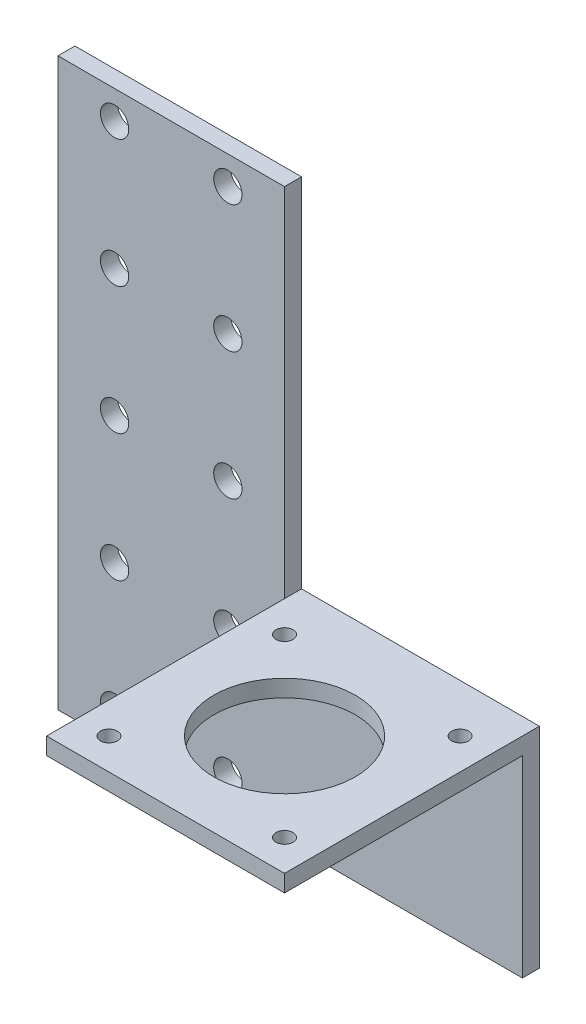
ISO-10303-21;
HEADER;
FILE_DESCRIPTION(('STEP AP214'),'2;1');
FILE_NAME('part.step','',(''),(''),'','','');
FILE_SCHEMA(('AUTOMOTIVE_DESIGN { 1 0 10303 214 1 1 1 1 }'));
ENDSEC;
DATA;
#1=APPLICATION_CONTEXT('core data for automotive mechanical design processes');
#2=APPLICATION_PROTOCOL_DEFINITION('international standard','automotive_design',2000,#1);
#3=PRODUCT_CONTEXT('',#1,'mechanical');
#4=PRODUCT('Part','Part','',(#3));
#5=PRODUCT_RELATED_PRODUCT_CATEGORY('part','',(#4));
#6=PRODUCT_DEFINITION_FORMATION('','',#4);
#7=PRODUCT_DEFINITION_CONTEXT('part definition',#1,'design');
#8=PRODUCT_DEFINITION('design','',#6,#7);
#9=PRODUCT_DEFINITION_SHAPE('','',#8);
#10=(LENGTH_UNIT() NAMED_UNIT(*) SI_UNIT(.MILLI.,.METRE.));
#11=(NAMED_UNIT(*) PLANE_ANGLE_UNIT() SI_UNIT($,.RADIAN.));
#12=(NAMED_UNIT(*) SI_UNIT($,.STERADIAN.) SOLID_ANGLE_UNIT());
#13=UNCERTAINTY_MEASURE_WITH_UNIT(LENGTH_MEASURE(1.E-05),#10,'distance_accuracy_value','');
#14=(GEOMETRIC_REPRESENTATION_CONTEXT(3) GLOBAL_UNCERTAINTY_ASSIGNED_CONTEXT((#13)) GLOBAL_UNIT_ASSIGNED_CONTEXT((#10,
#11,#12)) REPRESENTATION_CONTEXT('',''));
#15=CARTESIAN_POINT('',(0.,0.,0.));
#16=DIRECTION('',(0.,0.,1.));
#17=DIRECTION('',(1.,0.,0.));
#18=AXIS2_PLACEMENT_3D('',#15,#16,#17);
#19=CARTESIAN_POINT('',(40.,0.,3.));
#20=DIRECTION('',(-1.,0.,0.));
#21=DIRECTION('',(0.,-1.,0.));
#22=AXIS2_PLACEMENT_3D('',#19,#20,#21);
#23=PLANE('',#22);
#24=DIRECTION('',(0.,0.,1.));
#25=VECTOR('',#24,1.);
#26=CARTESIAN_POINT('',(40.,-63.,0.));
#27=LINE('',#26,#25);
#28=CARTESIAN_POINT('',(40.,-63.,0.));
#29=VERTEX_POINT('',#28);
#30=CARTESIAN_POINT('',(40.,-63.,3.));
#31=VERTEX_POINT('',#30);
#32=EDGE_CURVE('E55',#29,#31,#27,.T.);
#33=ORIENTED_EDGE('',*,*,#32,.F.);
#34=DIRECTION('',(0.,1.,0.));
#35=VECTOR('',#34,1.);
#36=CARTESIAN_POINT('',(40.,0.,0.));
#37=LINE('',#36,#35);
#38=CARTESIAN_POINT('',(40.,0.,0.));
#39=VERTEX_POINT('',#38);
#40=EDGE_CURVE('E121',#29,#39,#37,.T.);
#41=ORIENTED_EDGE('',*,*,#40,.T.);
#42=DIRECTION('',(0.,0.,-1.));
#43=VECTOR('',#42,1.);
#44=CARTESIAN_POINT('',(40.,0.,3.));
#45=LINE('',#44,#43);
#46=CARTESIAN_POINT('',(40.,0.,3.));
#47=VERTEX_POINT('',#46);
#48=EDGE_CURVE('E11',#47,#39,#45,.T.);
#49=ORIENTED_EDGE('',*,*,#48,.F.);
#50=DIRECTION('',(0.,1.,0.));
#51=VECTOR('',#50,1.);
#52=CARTESIAN_POINT('',(40.,0.,3.));
#53=LINE('',#52,#51);
#54=EDGE_CURVE('E50',#31,#47,#53,.T.);
#55=ORIENTED_EDGE('',*,*,#54,.F.);
#56=EDGE_LOOP('',(#33,#41,#49,#55));
#57=FACE_BOUND('',#56,.T.);
#58=ADVANCED_FACE('F36',(#57),#23,.F.);
#59=CARTESIAN_POINT('',(0.,0.,3.));
#60=DIRECTION('',(0.,0.,1.));
#61=DIRECTION('',(1.,0.,0.));
#62=AXIS2_PLACEMENT_3D('',#59,#60,#61);
#63=PLANE('',#62);
#64=CARTESIAN_POINT('',(30.,-72.5,3.));
#65=DIRECTION('',(0.,0.,1.));
#66=DIRECTION('',(1.,0.,0.));
#67=AXIS2_PLACEMENT_3D('',#64,#65,#66);
#68=CIRCLE('',#67,2.5);
#69=CARTESIAN_POINT('',(32.5,-72.5,3.));
#70=VERTEX_POINT('',#69);
#71=EDGE_CURVE('E155',#70,#70,#68,.T.);
#72=ORIENTED_EDGE('',*,*,#71,.F.);
#73=EDGE_LOOP('',(#72));
#74=FACE_BOUND('',#73,.T.);
#75=CARTESIAN_POINT('',(30.,-27.5,3.));
#76=DIRECTION('',(0.,0.,1.));
#77=DIRECTION('',(1.,0.,0.));
#78=AXIS2_PLACEMENT_3D('',#75,#76,#77);
#79=CIRCLE('',#78,2.5);
#80=CARTESIAN_POINT('',(32.5,-27.5,3.));
#81=VERTEX_POINT('',#80);
#82=EDGE_CURVE('E167',#81,#81,#79,.T.);
#83=ORIENTED_EDGE('',*,*,#82,.F.);
#84=EDGE_LOOP('',(#83));
#85=FACE_BOUND('',#84,.T.);
#86=CARTESIAN_POINT('',(10.,-72.5000000000004,3.));
#87=DIRECTION('',(0.,0.,1.));
#88=DIRECTION('',(1.,0.,0.));
#89=AXIS2_PLACEMENT_3D('',#86,#87,#88);
#90=CIRCLE('',#89,2.5);
#91=CARTESIAN_POINT('',(12.5,-72.5000000000004,3.));
#92=VERTEX_POINT('',#91);
#93=EDGE_CURVE('E179',#92,#92,#90,.T.);
#94=ORIENTED_EDGE('',*,*,#93,.F.);
#95=EDGE_LOOP('',(#94));
#96=FACE_BOUND('',#95,.T.);
#97=CARTESIAN_POINT('',(10.,-27.5000000000004,3.));
#98=DIRECTION('',(0.,0.,1.));
#99=DIRECTION('',(1.,0.,0.));
#100=AXIS2_PLACEMENT_3D('',#97,#98,#99);
#101=CIRCLE('',#100,2.5);
#102=CARTESIAN_POINT('',(12.5,-27.5000000000004,3.));
#103=VERTEX_POINT('',#102);
#104=EDGE_CURVE('E191',#103,#103,#101,.T.);
#105=ORIENTED_EDGE('',*,*,#104,.F.);
#106=EDGE_LOOP('',(#105));
#107=FACE_BOUND('',#106,.T.);
#108=CARTESIAN_POINT('',(10.,-5.00000000000041,3.));
#109=DIRECTION('',(0.,0.,1.));
#110=DIRECTION('',(1.,0.,0.));
#111=AXIS2_PLACEMENT_3D('',#108,#109,#110);
#112=CIRCLE('',#111,2.5);
#113=CARTESIAN_POINT('',(12.5,-5.00000000000041,3.));
#114=VERTEX_POINT('',#113);
#115=EDGE_CURVE('E203',#114,#114,#112,.T.);
#116=ORIENTED_EDGE('',*,*,#115,.F.);
#117=EDGE_LOOP('',(#116));
#118=FACE_BOUND('',#117,.T.);
#119=CARTESIAN_POINT('',(40.,-66.,3.));
#120=VERTEX_POINT('',#119);
#121=EDGE_CURVE('E208',#120,#31,#53,.T.);
#122=ORIENTED_EDGE('',*,*,#121,.T.);
#123=ORIENTED_EDGE('',*,*,#54,.T.);
#124=DIRECTION('',(-1.,0.,0.));
#125=VECTOR('',#124,1.);
#126=CARTESIAN_POINT('',(40.,0.,3.));
#127=LINE('',#126,#125);
#128=CARTESIAN_POINT('',(0.,0.,3.));
#129=VERTEX_POINT('',#128);
#130=EDGE_CURVE('E210',#47,#129,#127,.T.);
#131=ORIENTED_EDGE('',*,*,#130,.T.);
#132=DIRECTION('',(0.,-1.,0.));
#133=VECTOR('',#132,1.);
#134=CARTESIAN_POINT('',(0.,0.,3.));
#135=LINE('',#134,#133);
#136=CARTESIAN_POINT('',(0.,-100.,3.));
#137=VERTEX_POINT('',#136);
#138=EDGE_CURVE('E212',#129,#137,#135,.T.);
#139=ORIENTED_EDGE('',*,*,#138,.T.);
#140=DIRECTION('',(1.,0.,0.));
#141=VECTOR('',#140,1.);
#142=CARTESIAN_POINT('',(82.,-100.,3.));
#143=LINE('',#142,#141);
#144=CARTESIAN_POINT('',(82.,-100.,3.));
#145=VERTEX_POINT('',#144);
#146=EDGE_CURVE('E214',#137,#145,#143,.T.);
#147=ORIENTED_EDGE('',*,*,#146,.T.);
#148=DIRECTION('',(0.,1.,0.));
#149=VECTOR('',#148,1.);
#150=CARTESIAN_POINT('',(82.,-100.,3.));
#151=LINE('',#150,#149);
#152=CARTESIAN_POINT('',(82.,-66.,3.));
#153=VERTEX_POINT('',#152);
#154=EDGE_CURVE('E216',#145,#153,#151,.T.);
#155=ORIENTED_EDGE('',*,*,#154,.T.);
#156=DIRECTION('',(-1.,0.,0.));
#157=VECTOR('',#156,1.);
#158=CARTESIAN_POINT('',(40.,-66.,3.));
#159=LINE('',#158,#157);
#160=EDGE_CURVE('E218',#153,#120,#159,.T.);
#161=ORIENTED_EDGE('',*,*,#160,.T.);
#162=EDGE_LOOP('',(#122,#123,#131,#139,#147,#155,#161));
#163=FACE_BOUND('',#162,.T.);
#164=CARTESIAN_POINT('',(30.,-5.,3.));
#165=DIRECTION('',(0.,0.,1.));
#166=DIRECTION('',(1.,0.,0.));
#167=AXIS2_PLACEMENT_3D('',#164,#165,#166);
#168=CIRCLE('',#167,2.50000000000001);
#169=CARTESIAN_POINT('',(32.5,-5.,3.));
#170=VERTEX_POINT('',#169);
#171=EDGE_CURVE('E197',#170,#170,#168,.T.);
#172=ORIENTED_EDGE('',*,*,#171,.F.);
#173=EDGE_LOOP('',(#172));
#174=FACE_BOUND('',#173,.T.);
#175=CARTESIAN_POINT('',(10.,-50.0000000000004,3.));
#176=DIRECTION('',(0.,0.,1.));
#177=DIRECTION('',(1.,0.,0.));
#178=AXIS2_PLACEMENT_3D('',#175,#176,#177);
#179=CIRCLE('',#178,2.5);
#180=CARTESIAN_POINT('',(12.5,-50.0000000000004,3.));
#181=VERTEX_POINT('',#180);
#182=EDGE_CURVE('E185',#181,#181,#179,.T.);
#183=ORIENTED_EDGE('',*,*,#182,.F.);
#184=EDGE_LOOP('',(#183));
#185=FACE_BOUND('',#184,.T.);
#186=CARTESIAN_POINT('',(10.,-95.0000000000004,3.));
#187=DIRECTION('',(0.,0.,1.));
#188=DIRECTION('',(1.,0.,0.));
#189=AXIS2_PLACEMENT_3D('',#186,#187,#188);
#190=CIRCLE('',#189,2.5);
#191=CARTESIAN_POINT('',(12.5,-95.0000000000004,3.));
#192=VERTEX_POINT('',#191);
#193=EDGE_CURVE('E173',#192,#192,#190,.T.);
#194=ORIENTED_EDGE('',*,*,#193,.F.);
#195=EDGE_LOOP('',(#194));
#196=FACE_BOUND('',#195,.T.);
#197=CARTESIAN_POINT('',(30.,-50.,3.));
#198=DIRECTION('',(0.,0.,1.));
#199=DIRECTION('',(1.,0.,0.));
#200=AXIS2_PLACEMENT_3D('',#197,#198,#199);
#201=CIRCLE('',#200,2.5);
#202=CARTESIAN_POINT('',(32.5,-50.,3.));
#203=VERTEX_POINT('',#202);
#204=EDGE_CURVE('E161',#203,#203,#201,.T.);
#205=ORIENTED_EDGE('',*,*,#204,.F.);
#206=EDGE_LOOP('',(#205));
#207=FACE_BOUND('',#206,.T.);
#208=CARTESIAN_POINT('',(30.,-95.,3.));
#209=DIRECTION('',(0.,0.,1.));
#210=DIRECTION('',(1.,0.,0.));
#211=AXIS2_PLACEMENT_3D('',#208,#209,#210);
#212=CIRCLE('',#211,2.50000000000001);
#213=CARTESIAN_POINT('',(32.5,-95.,3.));
#214=VERTEX_POINT('',#213);
#215=EDGE_CURVE('E149',#214,#214,#212,.T.);
#216=ORIENTED_EDGE('',*,*,#215,.F.);
#217=EDGE_LOOP('',(#216));
#218=FACE_BOUND('',#217,.T.);
#219=ADVANCED_FACE('F242',(#74,#85,#96,#107,#118,#163,#174,#185,#196,#207,#218),#63,.T.);
#220=CARTESIAN_POINT('',(0.,0.,0.));
#221=DIRECTION('',(0.,0.,1.));
#222=DIRECTION('',(1.,0.,0.));
#223=AXIS2_PLACEMENT_3D('',#220,#221,#222);
#224=PLANE('',#223);
#225=ORIENTED_EDGE('',*,*,#40,.F.);
#226=DIRECTION('',(-1.,0.,0.));
#227=VECTOR('',#226,1.);
#228=CARTESIAN_POINT('',(82.,-63.,0.));
#229=LINE('',#228,#227);
#230=CARTESIAN_POINT('',(82.,-63.,0.));
#231=VERTEX_POINT('',#230);
#232=EDGE_CURVE('E117',#231,#29,#229,.T.);
#233=ORIENTED_EDGE('',*,*,#232,.F.);
#234=DIRECTION('',(0.,1.,0.));
#235=VECTOR('',#234,1.);
#236=CARTESIAN_POINT('',(82.,-100.,0.));
#237=LINE('',#236,#235);
#238=CARTESIAN_POINT('',(82.,-100.,0.));
#239=VERTEX_POINT('',#238);
#240=EDGE_CURVE('E103',#239,#231,#237,.T.);
#241=ORIENTED_EDGE('',*,*,#240,.F.);
#242=DIRECTION('',(1.,0.,0.));
#243=VECTOR('',#242,1.);
#244=CARTESIAN_POINT('',(82.,-100.,0.));
#245=LINE('',#244,#243);
#246=CARTESIAN_POINT('',(0.,-100.,0.));
#247=VERTEX_POINT('',#246);
#248=EDGE_CURVE('E114',#247,#239,#245,.T.);
#249=ORIENTED_EDGE('',*,*,#248,.F.);
#250=DIRECTION('',(0.,-1.,0.));
#251=VECTOR('',#250,1.);
#252=CARTESIAN_POINT('',(0.,0.,0.));
#253=LINE('',#252,#251);
#254=CARTESIAN_POINT('',(0.,0.,0.));
#255=VERTEX_POINT('',#254);
#256=EDGE_CURVE('E223',#255,#247,#253,.T.);
#257=ORIENTED_EDGE('',*,*,#256,.F.);
#258=DIRECTION('',(-1.,0.,0.));
#259=VECTOR('',#258,1.);
#260=CARTESIAN_POINT('',(40.,0.,0.));
#261=LINE('',#260,#259);
#262=EDGE_CURVE('E221',#39,#255,#261,.T.);
#263=ORIENTED_EDGE('',*,*,#262,.F.);
#264=EDGE_LOOP('',(#225,#233,#241,#249,#257,#263));
#265=FACE_BOUND('',#264,.T.);
#266=CARTESIAN_POINT('',(10.,-5.00000000000041,0.));
#267=DIRECTION('',(0.,0.,1.));
#268=DIRECTION('',(1.,0.,0.));
#269=AXIS2_PLACEMENT_3D('',#266,#267,#268);
#270=CIRCLE('',#269,2.5);
#271=CARTESIAN_POINT('',(12.5,-5.00000000000041,0.));
#272=VERTEX_POINT('',#271);
#273=EDGE_CURVE('E200',#272,#272,#270,.T.);
#274=ORIENTED_EDGE('',*,*,#273,.T.);
#275=EDGE_LOOP('',(#274));
#276=FACE_BOUND('',#275,.T.);
#277=CARTESIAN_POINT('',(30.,-5.,0.));
#278=DIRECTION('',(0.,0.,1.));
#279=DIRECTION('',(1.,0.,0.));
#280=AXIS2_PLACEMENT_3D('',#277,#278,#279);
#281=CIRCLE('',#280,2.50000000000001);
#282=CARTESIAN_POINT('',(32.5,-5.,0.));
#283=VERTEX_POINT('',#282);
#284=EDGE_CURVE('E194',#283,#283,#281,.T.);
#285=ORIENTED_EDGE('',*,*,#284,.T.);
#286=EDGE_LOOP('',(#285));
#287=FACE_BOUND('',#286,.T.);
#288=CARTESIAN_POINT('',(10.,-27.5000000000004,0.));
#289=DIRECTION('',(0.,0.,1.));
#290=DIRECTION('',(1.,0.,0.));
#291=AXIS2_PLACEMENT_3D('',#288,#289,#290);
#292=CIRCLE('',#291,2.5);
#293=CARTESIAN_POINT('',(12.5,-27.5000000000004,0.));
#294=VERTEX_POINT('',#293);
#295=EDGE_CURVE('E188',#294,#294,#292,.T.);
#296=ORIENTED_EDGE('',*,*,#295,.T.);
#297=EDGE_LOOP('',(#296));
#298=FACE_BOUND('',#297,.T.);
#299=CARTESIAN_POINT('',(10.,-50.0000000000004,0.));
#300=DIRECTION('',(0.,0.,1.));
#301=DIRECTION('',(1.,0.,0.));
#302=AXIS2_PLACEMENT_3D('',#299,#300,#301);
#303=CIRCLE('',#302,2.5);
#304=CARTESIAN_POINT('',(12.5,-50.0000000000004,0.));
#305=VERTEX_POINT('',#304);
#306=EDGE_CURVE('E182',#305,#305,#303,.T.);
#307=ORIENTED_EDGE('',*,*,#306,.T.);
#308=EDGE_LOOP('',(#307));
#309=FACE_BOUND('',#308,.T.);
#310=CARTESIAN_POINT('',(10.,-72.5000000000004,0.));
#311=DIRECTION('',(0.,0.,1.));
#312=DIRECTION('',(1.,0.,0.));
#313=AXIS2_PLACEMENT_3D('',#310,#311,#312);
#314=CIRCLE('',#313,2.5);
#315=CARTESIAN_POINT('',(12.5,-72.5000000000004,0.));
#316=VERTEX_POINT('',#315);
#317=EDGE_CURVE('E176',#316,#316,#314,.T.);
#318=ORIENTED_EDGE('',*,*,#317,.T.);
#319=EDGE_LOOP('',(#318));
#320=FACE_BOUND('',#319,.T.);
#321=CARTESIAN_POINT('',(10.,-95.0000000000004,0.));
#322=DIRECTION('',(0.,0.,1.));
#323=DIRECTION('',(1.,0.,0.));
#324=AXIS2_PLACEMENT_3D('',#321,#322,#323);
#325=CIRCLE('',#324,2.5);
#326=CARTESIAN_POINT('',(12.5,-95.0000000000004,0.));
#327=VERTEX_POINT('',#326);
#328=EDGE_CURVE('E170',#327,#327,#325,.T.);
#329=ORIENTED_EDGE('',*,*,#328,.T.);
#330=EDGE_LOOP('',(#329));
#331=FACE_BOUND('',#330,.T.);
#332=CARTESIAN_POINT('',(30.,-27.5,0.));
#333=DIRECTION('',(0.,0.,1.));
#334=DIRECTION('',(1.,0.,0.));
#335=AXIS2_PLACEMENT_3D('',#332,#333,#334);
#336=CIRCLE('',#335,2.5);
#337=CARTESIAN_POINT('',(32.5,-27.5,0.));
#338=VERTEX_POINT('',#337);
#339=EDGE_CURVE('E164',#338,#338,#336,.T.);
#340=ORIENTED_EDGE('',*,*,#339,.T.);
#341=EDGE_LOOP('',(#340));
#342=FACE_BOUND('',#341,.T.);
#343=CARTESIAN_POINT('',(30.,-50.,0.));
#344=DIRECTION('',(0.,0.,1.));
#345=DIRECTION('',(1.,0.,0.));
#346=AXIS2_PLACEMENT_3D('',#343,#344,#345);
#347=CIRCLE('',#346,2.5);
#348=CARTESIAN_POINT('',(32.5,-50.,0.));
#349=VERTEX_POINT('',#348);
#350=EDGE_CURVE('E158',#349,#349,#347,.T.);
#351=ORIENTED_EDGE('',*,*,#350,.T.);
#352=EDGE_LOOP('',(#351));
#353=FACE_BOUND('',#352,.T.);
#354=CARTESIAN_POINT('',(30.,-72.5,0.));
#355=DIRECTION('',(0.,0.,1.));
#356=DIRECTION('',(1.,0.,0.));
#357=AXIS2_PLACEMENT_3D('',#354,#355,#356);
#358=CIRCLE('',#357,2.5);
#359=CARTESIAN_POINT('',(32.5,-72.5,0.));
#360=VERTEX_POINT('',#359);
#361=EDGE_CURVE('E152',#360,#360,#358,.T.);
#362=ORIENTED_EDGE('',*,*,#361,.T.);
#363=EDGE_LOOP('',(#362));
#364=FACE_BOUND('',#363,.T.);
#365=CARTESIAN_POINT('',(30.,-95.,0.));
#366=DIRECTION('',(0.,0.,1.));
#367=DIRECTION('',(1.,0.,0.));
#368=AXIS2_PLACEMENT_3D('',#365,#366,#367);
#369=CIRCLE('',#368,2.50000000000001);
#370=CARTESIAN_POINT('',(32.5,-95.,0.));
#371=VERTEX_POINT('',#370);
#372=EDGE_CURVE('E148',#371,#371,#369,.T.);
#373=ORIENTED_EDGE('',*,*,#372,.T.);
#374=EDGE_LOOP('',(#373));
#375=FACE_BOUND('',#374,.T.);
#376=ADVANCED_FACE('F118',(#265,#276,#287,#298,#309,#320,#331,#342,#353,#364,#375),#224,.F.);
#377=CARTESIAN_POINT('',(40.,0.,3.));
#378=DIRECTION('',(0.,-1.,0.));
#379=DIRECTION('',(1.,0.,0.));
#380=AXIS2_PLACEMENT_3D('',#377,#378,#379);
#381=PLANE('',#380);
#382=ORIENTED_EDGE('',*,*,#262,.T.);
#383=DIRECTION('',(0.,0.,-1.));
#384=VECTOR('',#383,1.);
#385=CARTESIAN_POINT('',(0.,0.,3.));
#386=LINE('',#385,#384);
#387=EDGE_CURVE('E43',#129,#255,#386,.T.);
#388=ORIENTED_EDGE('',*,*,#387,.F.);
#389=ORIENTED_EDGE('',*,*,#130,.F.);
#390=ORIENTED_EDGE('',*,*,#48,.T.);
#391=EDGE_LOOP('',(#382,#388,#389,#390));
#392=FACE_BOUND('',#391,.T.);
#393=ADVANCED_FACE('F245',(#392),#381,.F.);
#394=CARTESIAN_POINT('',(0.,0.,3.));
#395=DIRECTION('',(1.,0.,0.));
#396=DIRECTION('',(0.,1.,0.));
#397=AXIS2_PLACEMENT_3D('',#394,#395,#396);
#398=PLANE('',#397);
#399=ORIENTED_EDGE('',*,*,#256,.T.);
#400=DIRECTION('',(0.,0.,-1.));
#401=VECTOR('',#400,1.);
#402=CARTESIAN_POINT('',(0.,-100.,3.));
#403=LINE('',#402,#401);
#404=EDGE_CURVE('E227',#137,#247,#403,.T.);
#405=ORIENTED_EDGE('',*,*,#404,.F.);
#406=ORIENTED_EDGE('',*,*,#138,.F.);
#407=ORIENTED_EDGE('',*,*,#387,.T.);
#408=EDGE_LOOP('',(#399,#405,#406,#407));
#409=FACE_BOUND('',#408,.T.);
#410=ADVANCED_FACE('F234',(#409),#398,.F.);
#411=CARTESIAN_POINT('',(82.,-100.,3.));
#412=DIRECTION('',(0.,1.,0.));
#413=DIRECTION('',(0.,0.,1.));
#414=AXIS2_PLACEMENT_3D('',#411,#412,#413);
#415=PLANE('',#414);
#416=ORIENTED_EDGE('',*,*,#248,.T.);
#417=DIRECTION('',(0.,0.,-1.));
#418=VECTOR('',#417,1.);
#419=CARTESIAN_POINT('',(82.,-100.,3.));
#420=LINE('',#419,#418);
#421=EDGE_CURVE('E111',#145,#239,#420,.T.);
#422=ORIENTED_EDGE('',*,*,#421,.F.);
#423=ORIENTED_EDGE('',*,*,#146,.F.);
#424=ORIENTED_EDGE('',*,*,#404,.T.);
#425=EDGE_LOOP('',(#416,#422,#423,#424));
#426=FACE_BOUND('',#425,.T.);
#427=ADVANCED_FACE('F239',(#426),#415,.F.);
#428=CARTESIAN_POINT('',(82.,-100.,3.));
#429=DIRECTION('',(-1.,0.,0.));
#430=DIRECTION('',(0.,-1.,0.));
#431=AXIS2_PLACEMENT_3D('',#428,#429,#430);
#432=PLANE('',#431);
#433=ORIENTED_EDGE('',*,*,#240,.T.);
#434=DIRECTION('',(0.,0.,-1.));
#435=VECTOR('',#434,1.);
#436=CARTESIAN_POINT('',(82.,-63.,0.));
#437=LINE('',#436,#435);
#438=CARTESIAN_POINT('',(82.,-63.,45.));
#439=VERTEX_POINT('',#438);
#440=EDGE_CURVE('E108',#439,#231,#437,.T.);
#441=ORIENTED_EDGE('',*,*,#440,.F.);
#442=DIRECTION('',(0.,-1.,0.));
#443=VECTOR('',#442,1.);
#444=CARTESIAN_POINT('',(82.,-63.,45.));
#445=LINE('',#444,#443);
#446=CARTESIAN_POINT('',(82.,-66.,45.));
#447=VERTEX_POINT('',#446);
#448=EDGE_CURVE('E139',#439,#447,#445,.T.);
#449=ORIENTED_EDGE('',*,*,#448,.T.);
#450=DIRECTION('',(0.,0.,-1.));
#451=VECTOR('',#450,1.);
#452=CARTESIAN_POINT('',(82.,-66.,0.));
#453=LINE('',#452,#451);
#454=EDGE_CURVE('E140',#447,#153,#453,.T.);
#455=ORIENTED_EDGE('',*,*,#454,.T.);
#456=ORIENTED_EDGE('',*,*,#154,.F.);
#457=ORIENTED_EDGE('',*,*,#421,.T.);
#458=EDGE_LOOP('',(#433,#441,#449,#455,#456,#457));
#459=FACE_BOUND('',#458,.T.);
#460=ADVANCED_FACE('F105',(#459),#432,.F.);
#461=CARTESIAN_POINT('',(10.,-5.00000000000041,3.));
#462=DIRECTION('',(0.,0.,-1.));
#463=DIRECTION('',(-1.,0.,0.));
#464=AXIS2_PLACEMENT_3D('',#461,#462,#463);
#465=CYLINDRICAL_SURFACE('',#464,2.5);
#466=ORIENTED_EDGE('',*,*,#115,.T.);
#467=EDGE_LOOP('',(#466));
#468=FACE_BOUND('',#467,.T.);
#469=ORIENTED_EDGE('',*,*,#273,.F.);
#470=EDGE_LOOP('',(#469));
#471=FACE_BOUND('',#470,.T.);
#472=ADVANCED_FACE('F259',(#468,#471),#465,.F.);
#473=CARTESIAN_POINT('',(30.,-5.,3.));
#474=DIRECTION('',(0.,0.,-1.));
#475=DIRECTION('',(-1.,0.,0.));
#476=AXIS2_PLACEMENT_3D('',#473,#474,#475);
#477=CYLINDRICAL_SURFACE('',#476,2.50000000000001);
#478=ORIENTED_EDGE('',*,*,#171,.T.);
#479=EDGE_LOOP('',(#478));
#480=FACE_BOUND('',#479,.T.);
#481=ORIENTED_EDGE('',*,*,#284,.F.);
#482=EDGE_LOOP('',(#481));
#483=FACE_BOUND('',#482,.T.);
#484=ADVANCED_FACE('F291',(#480,#483),#477,.F.);
#485=CARTESIAN_POINT('',(10.,-27.5000000000004,3.));
#486=DIRECTION('',(0.,0.,-1.));
#487=DIRECTION('',(-1.,0.,0.));
#488=AXIS2_PLACEMENT_3D('',#485,#486,#487);
#489=CYLINDRICAL_SURFACE('',#488,2.5);
#490=ORIENTED_EDGE('',*,*,#104,.T.);
#491=EDGE_LOOP('',(#490));
#492=FACE_BOUND('',#491,.T.);
#493=ORIENTED_EDGE('',*,*,#295,.F.);
#494=EDGE_LOOP('',(#493));
#495=FACE_BOUND('',#494,.T.);
#496=ADVANCED_FACE('F298',(#492,#495),#489,.F.);
#497=CARTESIAN_POINT('',(10.,-50.0000000000004,3.));
#498=DIRECTION('',(0.,0.,-1.));
#499=DIRECTION('',(-1.,0.,0.));
#500=AXIS2_PLACEMENT_3D('',#497,#498,#499);
#501=CYLINDRICAL_SURFACE('',#500,2.5);
#502=ORIENTED_EDGE('',*,*,#182,.T.);
#503=EDGE_LOOP('',(#502));
#504=FACE_BOUND('',#503,.T.);
#505=ORIENTED_EDGE('',*,*,#306,.F.);
#506=EDGE_LOOP('',(#505));
#507=FACE_BOUND('',#506,.T.);
#508=ADVANCED_FACE('F305',(#504,#507),#501,.F.);
#509=CARTESIAN_POINT('',(10.,-72.5000000000004,3.));
#510=DIRECTION('',(0.,0.,-1.));
#511=DIRECTION('',(-1.,0.,0.));
#512=AXIS2_PLACEMENT_3D('',#509,#510,#511);
#513=CYLINDRICAL_SURFACE('',#512,2.5);
#514=ORIENTED_EDGE('',*,*,#93,.T.);
#515=EDGE_LOOP('',(#514));
#516=FACE_BOUND('',#515,.T.);
#517=ORIENTED_EDGE('',*,*,#317,.F.);
#518=EDGE_LOOP('',(#517));
#519=FACE_BOUND('',#518,.T.);
#520=ADVANCED_FACE('F313',(#516,#519),#513,.F.);
#521=CARTESIAN_POINT('',(10.,-95.0000000000004,3.));
#522=DIRECTION('',(0.,0.,-1.));
#523=DIRECTION('',(-1.,0.,0.));
#524=AXIS2_PLACEMENT_3D('',#521,#522,#523);
#525=CYLINDRICAL_SURFACE('',#524,2.5);
#526=ORIENTED_EDGE('',*,*,#193,.T.);
#527=EDGE_LOOP('',(#526));
#528=FACE_BOUND('',#527,.T.);
#529=ORIENTED_EDGE('',*,*,#328,.F.);
#530=EDGE_LOOP('',(#529));
#531=FACE_BOUND('',#530,.T.);
#532=ADVANCED_FACE('F321',(#528,#531),#525,.F.);
#533=CARTESIAN_POINT('',(30.,-27.5,3.));
#534=DIRECTION('',(0.,0.,-1.));
#535=DIRECTION('',(-1.,0.,0.));
#536=AXIS2_PLACEMENT_3D('',#533,#534,#535);
#537=CYLINDRICAL_SURFACE('',#536,2.5);
#538=ORIENTED_EDGE('',*,*,#82,.T.);
#539=EDGE_LOOP('',(#538));
#540=FACE_BOUND('',#539,.T.);
#541=ORIENTED_EDGE('',*,*,#339,.F.);
#542=EDGE_LOOP('',(#541));
#543=FACE_BOUND('',#542,.T.);
#544=ADVANCED_FACE('F329',(#540,#543),#537,.F.);
#545=CARTESIAN_POINT('',(30.,-50.,3.));
#546=DIRECTION('',(0.,0.,-1.));
#547=DIRECTION('',(-1.,0.,0.));
#548=AXIS2_PLACEMENT_3D('',#545,#546,#547);
#549=CYLINDRICAL_SURFACE('',#548,2.5);
#550=ORIENTED_EDGE('',*,*,#204,.T.);
#551=EDGE_LOOP('',(#550));
#552=FACE_BOUND('',#551,.T.);
#553=ORIENTED_EDGE('',*,*,#350,.F.);
#554=EDGE_LOOP('',(#553));
#555=FACE_BOUND('',#554,.T.);
#556=ADVANCED_FACE('F337',(#552,#555),#549,.F.);
#557=CARTESIAN_POINT('',(30.,-72.5,3.));
#558=DIRECTION('',(0.,0.,-1.));
#559=DIRECTION('',(-1.,0.,0.));
#560=AXIS2_PLACEMENT_3D('',#557,#558,#559);
#561=CYLINDRICAL_SURFACE('',#560,2.5);
#562=ORIENTED_EDGE('',*,*,#71,.T.);
#563=EDGE_LOOP('',(#562));
#564=FACE_BOUND('',#563,.T.);
#565=ORIENTED_EDGE('',*,*,#361,.F.);
#566=EDGE_LOOP('',(#565));
#567=FACE_BOUND('',#566,.T.);
#568=ADVANCED_FACE('F345',(#564,#567),#561,.F.);
#569=CARTESIAN_POINT('',(30.,-95.,3.));
#570=DIRECTION('',(0.,0.,-1.));
#571=DIRECTION('',(-1.,0.,0.));
#572=AXIS2_PLACEMENT_3D('',#569,#570,#571);
#573=CYLINDRICAL_SURFACE('',#572,2.50000000000001);
#574=ORIENTED_EDGE('',*,*,#215,.T.);
#575=EDGE_LOOP('',(#574));
#576=FACE_BOUND('',#575,.T.);
#577=ORIENTED_EDGE('',*,*,#372,.F.);
#578=EDGE_LOOP('',(#577));
#579=FACE_BOUND('',#578,.T.);
#580=ADVANCED_FACE('F353',(#576,#579),#573,.F.);
#581=CARTESIAN_POINT('',(40.,-63.,0.));
#582=DIRECTION('',(1.,0.,0.));
#583=DIRECTION('',(0.,0.,-1.));
#584=AXIS2_PLACEMENT_3D('',#581,#582,#583);
#585=PLANE('',#584);
#586=ORIENTED_EDGE('',*,*,#121,.F.);
#587=DIRECTION('',(0.,0.,1.));
#588=VECTOR('',#587,1.);
#589=CARTESIAN_POINT('',(40.,-66.,0.));
#590=LINE('',#589,#588);
#591=CARTESIAN_POINT('',(40.,-66.,45.));
#592=VERTEX_POINT('',#591);
#593=EDGE_CURVE('E131',#120,#592,#590,.T.);
#594=ORIENTED_EDGE('',*,*,#593,.T.);
#595=DIRECTION('',(0.,-1.,0.));
#596=VECTOR('',#595,1.);
#597=CARTESIAN_POINT('',(40.,-63.,45.));
#598=LINE('',#597,#596);
#599=CARTESIAN_POINT('',(40.,-63.,45.));
#600=VERTEX_POINT('',#599);
#601=EDGE_CURVE('E145',#600,#592,#598,.T.);
#602=ORIENTED_EDGE('',*,*,#601,.F.);
#603=EDGE_CURVE('E123',#31,#600,#27,.T.);
#604=ORIENTED_EDGE('',*,*,#603,.F.);
#605=EDGE_LOOP('',(#586,#594,#602,#604));
#606=FACE_BOUND('',#605,.T.);
#607=ADVANCED_FACE('F361',(#606),#585,.F.);
#608=CARTESIAN_POINT('',(82.,-63.,45.));
#609=DIRECTION('',(0.,0.,-1.));
#610=DIRECTION('',(-1.,0.,0.));
#611=AXIS2_PLACEMENT_3D('',#608,#609,#610);
#612=PLANE('',#611);
#613=DIRECTION('',(1.,0.,0.));
#614=VECTOR('',#613,1.);
#615=CARTESIAN_POINT('',(82.,-66.,45.));
#616=LINE('',#615,#614);
#617=EDGE_CURVE('E129',#592,#447,#616,.T.);
#618=ORIENTED_EDGE('',*,*,#617,.T.);
#619=ORIENTED_EDGE('',*,*,#448,.F.);
#620=DIRECTION('',(1.,0.,0.));
#621=VECTOR('',#620,1.);
#622=CARTESIAN_POINT('',(82.,-63.,45.));
#623=LINE('',#622,#621);
#624=EDGE_CURVE('E127',#600,#439,#623,.T.);
#625=ORIENTED_EDGE('',*,*,#624,.F.);
#626=ORIENTED_EDGE('',*,*,#601,.T.);
#627=EDGE_LOOP('',(#618,#619,#625,#626));
#628=FACE_BOUND('',#627,.T.);
#629=ADVANCED_FACE('F368',(#628),#612,.F.);
#630=CARTESIAN_POINT('',(0.,-63.,0.));
#631=DIRECTION('',(0.,-1.,0.));
#632=DIRECTION('',(0.,0.,-1.));
#633=AXIS2_PLACEMENT_3D('',#630,#631,#632);
#634=PLANE('',#633);
#635=CARTESIAN_POINT('',(76.5,-63.,39.5));
#636=DIRECTION('',(0.,-1.,0.));
#637=DIRECTION('',(0.,0.,-1.));
#638=AXIS2_PLACEMENT_3D('',#635,#636,#637);
#639=CIRCLE('',#638,1.5);
#640=CARTESIAN_POINT('',(76.5,-63.,38.));
#641=VERTEX_POINT('',#640);
#642=EDGE_CURVE('E134',#641,#641,#639,.T.);
#643=ORIENTED_EDGE('',*,*,#642,.T.);
#644=EDGE_LOOP('',(#643));
#645=FACE_BOUND('',#644,.T.);
#646=CARTESIAN_POINT('',(76.5,-63.,8.50000000000001));
#647=DIRECTION('',(0.,-1.,0.));
#648=DIRECTION('',(0.,0.,-1.));
#649=AXIS2_PLACEMENT_3D('',#646,#647,#648);
#650=CIRCLE('',#649,1.5);
#651=CARTESIAN_POINT('',(76.5,-63.,7.00000000000002));
#652=VERTEX_POINT('',#651);
#653=EDGE_CURVE('E556',#652,#652,#650,.T.);
#654=ORIENTED_EDGE('',*,*,#653,.T.);
#655=EDGE_LOOP('',(#654));
#656=FACE_BOUND('',#655,.T.);
#657=CARTESIAN_POINT('',(45.5,-63.,8.50000000000001));
#658=DIRECTION('',(0.,-1.,0.));
#659=DIRECTION('',(0.,0.,-1.));
#660=AXIS2_PLACEMENT_3D('',#657,#658,#659);
#661=CIRCLE('',#660,1.5);
#662=CARTESIAN_POINT('',(45.5,-63.,7.));
#663=VERTEX_POINT('',#662);
#664=EDGE_CURVE('E558',#663,#663,#661,.T.);
#665=ORIENTED_EDGE('',*,*,#664,.T.);
#666=EDGE_LOOP('',(#665));
#667=FACE_BOUND('',#666,.T.);
#668=CARTESIAN_POINT('',(45.5,-63.,39.5));
#669=DIRECTION('',(0.,-1.,0.));
#670=DIRECTION('',(0.,0.,-1.));
#671=AXIS2_PLACEMENT_3D('',#668,#669,#670);
#672=CIRCLE('',#671,1.5);
#673=CARTESIAN_POINT('',(45.5,-63.,38.));
#674=VERTEX_POINT('',#673);
#675=EDGE_CURVE('E562',#674,#674,#672,.T.);
#676=ORIENTED_EDGE('',*,*,#675,.T.);
#677=EDGE_LOOP('',(#676));
#678=FACE_BOUND('',#677,.T.);
#679=CARTESIAN_POINT('',(61.,-63.,24.));
#680=DIRECTION('',(0.,-1.,0.));
#681=DIRECTION('',(0.,0.,-1.));
#682=AXIS2_PLACEMENT_3D('',#679,#680,#681);
#683=CIRCLE('',#682,12.5);
#684=CARTESIAN_POINT('',(61.,-63.,11.5));
#685=VERTEX_POINT('',#684);
#686=EDGE_CURVE('E567',#685,#685,#683,.T.);
#687=ORIENTED_EDGE('',*,*,#686,.T.);
#688=EDGE_LOOP('',(#687));
#689=FACE_BOUND('',#688,.T.);
#690=ORIENTED_EDGE('',*,*,#440,.T.);
#691=ORIENTED_EDGE('',*,*,#232,.T.);
#692=ORIENTED_EDGE('',*,*,#32,.T.);
#693=ORIENTED_EDGE('',*,*,#603,.T.);
#694=ORIENTED_EDGE('',*,*,#624,.T.);
#695=EDGE_LOOP('',(#690,#691,#692,#693,#694));
#696=FACE_BOUND('',#695,.T.);
#697=ADVANCED_FACE('F125',(#645,#656,#667,#678,#689,#696),#634,.F.);
#698=CARTESIAN_POINT('',(0.,-66.,0.));
#699=DIRECTION('',(0.,-1.,0.));
#700=DIRECTION('',(0.,0.,-1.));
#701=AXIS2_PLACEMENT_3D('',#698,#699,#700);
#702=PLANE('',#701);
#703=CARTESIAN_POINT('',(76.5,-66.,39.5));
#704=DIRECTION('',(0.,-1.,0.));
#705=DIRECTION('',(0.,0.,-1.));
#706=AXIS2_PLACEMENT_3D('',#703,#704,#705);
#707=CIRCLE('',#706,1.5);
#708=CARTESIAN_POINT('',(76.5,-66.,38.));
#709=VERTEX_POINT('',#708);
#710=EDGE_CURVE('E553',#709,#709,#707,.T.);
#711=ORIENTED_EDGE('',*,*,#710,.F.);
#712=EDGE_LOOP('',(#711));
#713=FACE_BOUND('',#712,.T.);
#714=CARTESIAN_POINT('',(76.5,-66.,8.50000000000001));
#715=DIRECTION('',(0.,-1.,0.));
#716=DIRECTION('',(0.,0.,-1.));
#717=AXIS2_PLACEMENT_3D('',#714,#715,#716);
#718=CIRCLE('',#717,1.5);
#719=CARTESIAN_POINT('',(76.5,-66.,7.00000000000002));
#720=VERTEX_POINT('',#719);
#721=EDGE_CURVE('E575',#720,#720,#718,.T.);
#722=ORIENTED_EDGE('',*,*,#721,.F.);
#723=EDGE_LOOP('',(#722));
#724=FACE_BOUND('',#723,.T.);
#725=CARTESIAN_POINT('',(45.5,-66.,8.50000000000001));
#726=DIRECTION('',(0.,-1.,0.));
#727=DIRECTION('',(0.,0.,-1.));
#728=AXIS2_PLACEMENT_3D('',#725,#726,#727);
#729=CIRCLE('',#728,1.5);
#730=CARTESIAN_POINT('',(45.5,-66.,7.));
#731=VERTEX_POINT('',#730);
#732=EDGE_CURVE('E578',#731,#731,#729,.T.);
#733=ORIENTED_EDGE('',*,*,#732,.F.);
#734=EDGE_LOOP('',(#733));
#735=FACE_BOUND('',#734,.T.);
#736=CARTESIAN_POINT('',(45.5,-66.,39.5));
#737=DIRECTION('',(0.,-1.,0.));
#738=DIRECTION('',(0.,0.,-1.));
#739=AXIS2_PLACEMENT_3D('',#736,#737,#738);
#740=CIRCLE('',#739,1.5);
#741=CARTESIAN_POINT('',(45.5,-66.,38.));
#742=VERTEX_POINT('',#741);
#743=EDGE_CURVE('E573',#742,#742,#740,.T.);
#744=ORIENTED_EDGE('',*,*,#743,.F.);
#745=EDGE_LOOP('',(#744));
#746=FACE_BOUND('',#745,.T.);
#747=CARTESIAN_POINT('',(61.,-66.,24.));
#748=DIRECTION('',(0.,-1.,0.));
#749=DIRECTION('',(0.,0.,-1.));
#750=AXIS2_PLACEMENT_3D('',#747,#748,#749);
#751=CIRCLE('',#750,12.5);
#752=CARTESIAN_POINT('',(61.,-66.,11.5));
#753=VERTEX_POINT('',#752);
#754=EDGE_CURVE('E570',#753,#753,#751,.T.);
#755=ORIENTED_EDGE('',*,*,#754,.F.);
#756=EDGE_LOOP('',(#755));
#757=FACE_BOUND('',#756,.T.);
#758=ORIENTED_EDGE('',*,*,#593,.F.);
#759=ORIENTED_EDGE('',*,*,#160,.F.);
#760=ORIENTED_EDGE('',*,*,#454,.F.);
#761=ORIENTED_EDGE('',*,*,#617,.F.);
#762=EDGE_LOOP('',(#758,#759,#760,#761));
#763=FACE_BOUND('',#762,.T.);
#764=ADVANCED_FACE('F383',(#713,#724,#735,#746,#757,#763),#702,.T.);
#765=CARTESIAN_POINT('',(61.,-53.,24.));
#766=DIRECTION('',(0.,-1.,0.));
#767=DIRECTION('',(0.,0.,-1.));
#768=AXIS2_PLACEMENT_3D('',#765,#766,#767);
#769=CYLINDRICAL_SURFACE('',#768,12.5);
#770=ORIENTED_EDGE('',*,*,#754,.T.);
#771=EDGE_LOOP('',(#770));
#772=FACE_BOUND('',#771,.T.);
#773=ORIENTED_EDGE('',*,*,#686,.F.);
#774=EDGE_LOOP('',(#773));
#775=FACE_BOUND('',#774,.T.);
#776=ADVANCED_FACE('F391',(#772,#775),#769,.F.);
#777=CARTESIAN_POINT('',(45.5,-53.,39.5));
#778=DIRECTION('',(0.,-1.,0.));
#779=DIRECTION('',(0.,0.,-1.));
#780=AXIS2_PLACEMENT_3D('',#777,#778,#779);
#781=CYLINDRICAL_SURFACE('',#780,1.5);
#782=ORIENTED_EDGE('',*,*,#743,.T.);
#783=EDGE_LOOP('',(#782));
#784=FACE_BOUND('',#783,.T.);
#785=ORIENTED_EDGE('',*,*,#675,.F.);
#786=EDGE_LOOP('',(#785));
#787=FACE_BOUND('',#786,.T.);
#788=ADVANCED_FACE('F399',(#784,#787),#781,.F.);
#789=CARTESIAN_POINT('',(45.5,-53.,8.50000000000001));
#790=DIRECTION('',(0.,-1.,0.));
#791=DIRECTION('',(0.,0.,-1.));
#792=AXIS2_PLACEMENT_3D('',#789,#790,#791);
#793=CYLINDRICAL_SURFACE('',#792,1.5);
#794=ORIENTED_EDGE('',*,*,#732,.T.);
#795=EDGE_LOOP('',(#794));
#796=FACE_BOUND('',#795,.T.);
#797=ORIENTED_EDGE('',*,*,#664,.F.);
#798=EDGE_LOOP('',(#797));
#799=FACE_BOUND('',#798,.T.);
#800=ADVANCED_FACE('F407',(#796,#799),#793,.F.);
#801=CARTESIAN_POINT('',(76.5,-53.,8.50000000000001));
#802=DIRECTION('',(0.,-1.,0.));
#803=DIRECTION('',(0.,0.,-1.));
#804=AXIS2_PLACEMENT_3D('',#801,#802,#803);
#805=CYLINDRICAL_SURFACE('',#804,1.5);
#806=ORIENTED_EDGE('',*,*,#721,.T.);
#807=EDGE_LOOP('',(#806));
#808=FACE_BOUND('',#807,.T.);
#809=ORIENTED_EDGE('',*,*,#653,.F.);
#810=EDGE_LOOP('',(#809));
#811=FACE_BOUND('',#810,.T.);
#812=ADVANCED_FACE('F415',(#808,#811),#805,.F.);
#813=CARTESIAN_POINT('',(76.5,-53.,39.5));
#814=DIRECTION('',(0.,-1.,0.));
#815=DIRECTION('',(0.,0.,-1.));
#816=AXIS2_PLACEMENT_3D('',#813,#814,#815);
#817=CYLINDRICAL_SURFACE('',#816,1.5);
#818=ORIENTED_EDGE('',*,*,#710,.T.);
#819=EDGE_LOOP('',(#818));
#820=FACE_BOUND('',#819,.T.);
#821=ORIENTED_EDGE('',*,*,#642,.F.);
#822=EDGE_LOOP('',(#821));
#823=FACE_BOUND('',#822,.T.);
#824=ADVANCED_FACE('F423',(#820,#823),#817,.F.);
#825=CLOSED_SHELL('',(#58,#219,#376,#393,#410,#427,#460,#472,#484,#496,#508,#520,#532,#544,#556,
#568,#580,#607,#629,#697,#764,#776,#788,#800,#812,#824));
#826=MANIFOLD_SOLID_BREP('B2',#825);
#827=ADVANCED_BREP_SHAPE_REPRESENTATION('',(#18,#826),#14);
#828=SHAPE_DEFINITION_REPRESENTATION(#9,#827);
ENDSEC;
END-ISO-10303-21;
